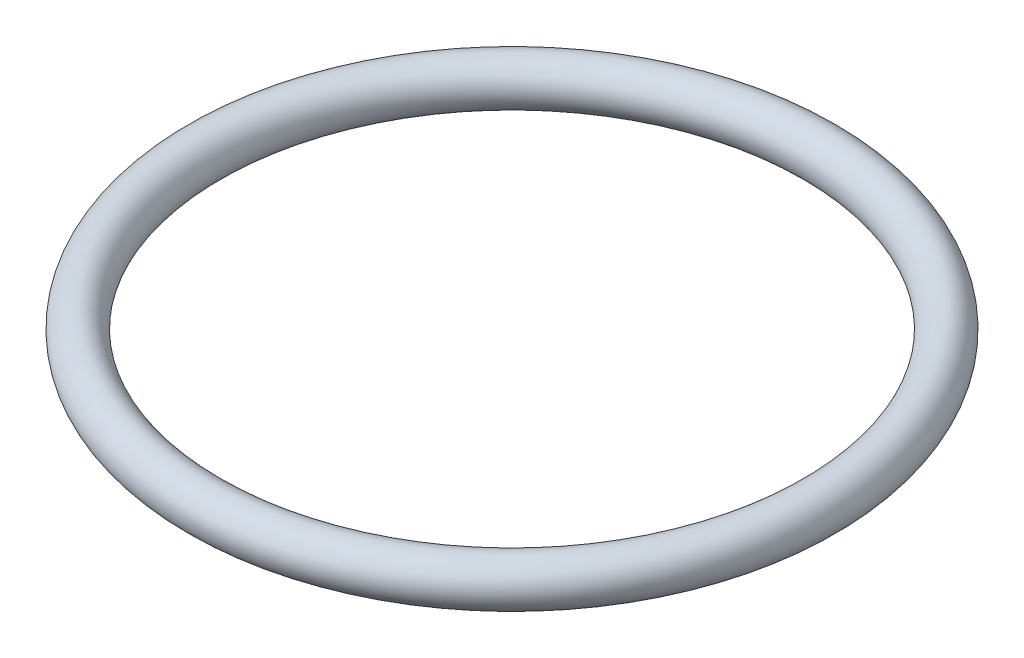
ISO-10303-21;
HEADER;
FILE_DESCRIPTION(('STEP AP214'),'2;1');
FILE_NAME('part.step','',(''),(''),'','','');
FILE_SCHEMA(('AUTOMOTIVE_DESIGN { 1 0 10303 214 1 1 1 1 }'));
ENDSEC;
DATA;
#1=APPLICATION_CONTEXT('core data for automotive mechanical design processes');
#2=APPLICATION_PROTOCOL_DEFINITION('international standard','automotive_design',2000,#1);
#3=PRODUCT_CONTEXT('',#1,'mechanical');
#4=PRODUCT('Part','Part','',(#3));
#5=PRODUCT_RELATED_PRODUCT_CATEGORY('part','',(#4));
#6=PRODUCT_DEFINITION_FORMATION('','',#4);
#7=PRODUCT_DEFINITION_CONTEXT('part definition',#1,'design');
#8=PRODUCT_DEFINITION('design','',#6,#7);
#9=PRODUCT_DEFINITION_SHAPE('','',#8);
#10=(LENGTH_UNIT() NAMED_UNIT(*) SI_UNIT(.MILLI.,.METRE.));
#11=(NAMED_UNIT(*) PLANE_ANGLE_UNIT() SI_UNIT($,.RADIAN.));
#12=(NAMED_UNIT(*) SI_UNIT($,.STERADIAN.) SOLID_ANGLE_UNIT());
#13=UNCERTAINTY_MEASURE_WITH_UNIT(LENGTH_MEASURE(1.E-05),#10,'distance_accuracy_value','');
#14=(GEOMETRIC_REPRESENTATION_CONTEXT(3) GLOBAL_UNCERTAINTY_ASSIGNED_CONTEXT((#13)) GLOBAL_UNIT_ASSIGNED_CONTEXT((#10,
#11,#12)) REPRESENTATION_CONTEXT('',''));
#15=CARTESIAN_POINT('',(0.,0.,0.));
#16=DIRECTION('',(0.,0.,1.));
#17=DIRECTION('',(1.,0.,0.));
#18=AXIS2_PLACEMENT_3D('',#15,#16,#17);
#19=CARTESIAN_POINT('',(0.,0.,0.));
#20=DIRECTION('',(0.,-1.,0.));
#21=DIRECTION('',(0.,0.,-1.));
#22=AXIS2_PLACEMENT_3D('',#19,#20,#21);
#23=TOROIDAL_SURFACE('',#22,10.25,0.75);
#24=CARTESIAN_POINT('',(0.,0.,-11.));
#25=VERTEX_POINT('',#24);
#26=VERTEX_LOOP('',#25);
#27=FACE_BOUND('',#26,.T.);
#28=ADVANCED_FACE('F34',(#27),#23,.T.);
#29=CLOSED_SHELL('',(#28));
#30=MANIFOLD_SOLID_BREP('B2',#29);
#31=ADVANCED_BREP_SHAPE_REPRESENTATION('',(#18,#30),#14);
#32=SHAPE_DEFINITION_REPRESENTATION(#9,#31);
ENDSEC;
END-ISO-10303-21;
